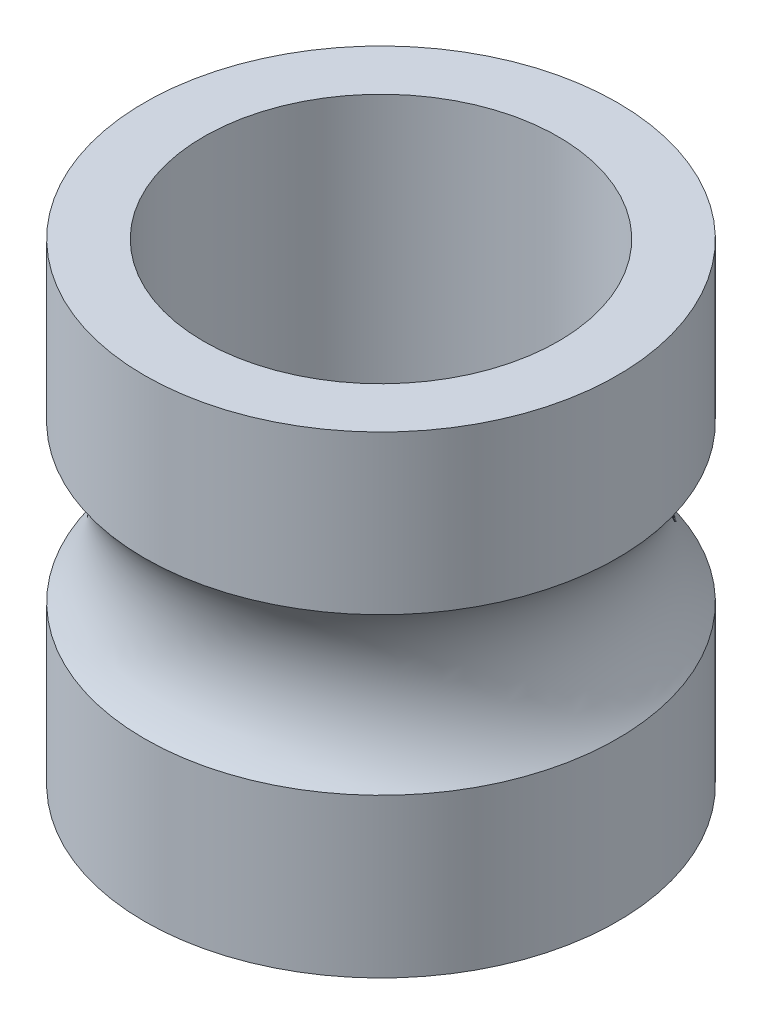
ISO-10303-21;
HEADER;
FILE_DESCRIPTION(('STEP AP214'),'2;1');
FILE_NAME('part.step','',(''),(''),'','','');
FILE_SCHEMA(('AUTOMOTIVE_DESIGN { 1 0 10303 214 1 1 1 1 }'));
ENDSEC;
DATA;
#1=APPLICATION_CONTEXT('core data for automotive mechanical design processes');
#2=APPLICATION_PROTOCOL_DEFINITION('international standard','automotive_design',2000,#1);
#3=PRODUCT_CONTEXT('',#1,'mechanical');
#4=PRODUCT('Part','Part','',(#3));
#5=PRODUCT_RELATED_PRODUCT_CATEGORY('part','',(#4));
#6=PRODUCT_DEFINITION_FORMATION('','',#4);
#7=PRODUCT_DEFINITION_CONTEXT('part definition',#1,'design');
#8=PRODUCT_DEFINITION('design','',#6,#7);
#9=PRODUCT_DEFINITION_SHAPE('','',#8);
#10=(LENGTH_UNIT() NAMED_UNIT(*) SI_UNIT(.MILLI.,.METRE.));
#11=(NAMED_UNIT(*) PLANE_ANGLE_UNIT() SI_UNIT($,.RADIAN.));
#12=(NAMED_UNIT(*) SI_UNIT($,.STERADIAN.) SOLID_ANGLE_UNIT());
#13=UNCERTAINTY_MEASURE_WITH_UNIT(LENGTH_MEASURE(1.E-05),#10,'distance_accuracy_value','');
#14=(GEOMETRIC_REPRESENTATION_CONTEXT(3) GLOBAL_UNCERTAINTY_ASSIGNED_CONTEXT((#13)) GLOBAL_UNIT_ASSIGNED_CONTEXT((#10,
#11,#12)) REPRESENTATION_CONTEXT('',''));
#15=CARTESIAN_POINT('',(0.,0.,0.));
#16=DIRECTION('',(0.,0.,1.));
#17=DIRECTION('',(1.,0.,0.));
#18=AXIS2_PLACEMENT_3D('',#15,#16,#17);
#19=CARTESIAN_POINT('',(0.,2.,0.));
#20=DIRECTION('',(0.,-1.,0.));
#21=DIRECTION('',(0.,0.,-1.));
#22=AXIS2_PLACEMENT_3D('',#19,#20,#21);
#23=CYLINDRICAL_SURFACE('',#22,2.);
#24=CARTESIAN_POINT('',(0.,2.,0.));
#25=DIRECTION('',(0.,1.,0.));
#26=DIRECTION('',(0.,0.,1.));
#27=AXIS2_PLACEMENT_3D('',#24,#25,#26);
#28=CIRCLE('',#27,2.);
#29=CARTESIAN_POINT('',(0.,2.,2.));
#30=VERTEX_POINT('',#29);
#31=EDGE_CURVE('E10',#30,#30,#28,.T.);
#32=ORIENTED_EDGE('',*,*,#31,.F.);
#33=EDGE_LOOP('',(#32));
#34=FACE_BOUND('',#33,.T.);
#35=CARTESIAN_POINT('',(0.,0.661437827766148,0.));
#36=DIRECTION('',(0.,-1.,0.));
#37=DIRECTION('',(0.,0.,-1.));
#38=AXIS2_PLACEMENT_3D('',#35,#36,#37);
#39=CIRCLE('',#38,2.);
#40=CARTESIAN_POINT('',(0.,0.661437827766148,-2.));
#41=VERTEX_POINT('',#40);
#42=EDGE_CURVE('E37',#41,#41,#39,.T.);
#43=ORIENTED_EDGE('',*,*,#42,.F.);
#44=EDGE_LOOP('',(#43));
#45=FACE_BOUND('',#44,.T.);
#46=ADVANCED_FACE('F34',(#34,#45),#23,.T.);
#47=CARTESIAN_POINT('',(0.,-2.,0.));
#48=DIRECTION('',(0.,1.,0.));
#49=DIRECTION('',(0.,0.,1.));
#50=AXIS2_PLACEMENT_3D('',#47,#48,#49);
#51=CIRCLE('',#50,2.);
#52=CARTESIAN_POINT('',(0.,-2.,2.));
#53=VERTEX_POINT('',#52);
#54=EDGE_CURVE('E42',#53,#53,#51,.T.);
#55=ORIENTED_EDGE('',*,*,#54,.T.);
#56=EDGE_LOOP('',(#55));
#57=FACE_BOUND('',#56,.T.);
#58=CARTESIAN_POINT('',(0.,-0.661437827766148,0.));
#59=DIRECTION('',(0.,1.,0.));
#60=DIRECTION('',(0.,0.,1.));
#61=AXIS2_PLACEMENT_3D('',#58,#59,#60);
#62=CIRCLE('',#61,2.);
#63=CARTESIAN_POINT('',(0.,-0.661437827766148,2.));
#64=VERTEX_POINT('',#63);
#65=EDGE_CURVE('E54',#64,#64,#62,.T.);
#66=ORIENTED_EDGE('',*,*,#65,.F.);
#67=EDGE_LOOP('',(#66));
#68=FACE_BOUND('',#67,.T.);
#69=ADVANCED_FACE('F76',(#57,#68),#23,.T.);
#70=CARTESIAN_POINT('',(0.,2.,0.));
#71=DIRECTION('',(0.,1.,0.));
#72=DIRECTION('',(0.,0.,1.));
#73=AXIS2_PLACEMENT_3D('',#70,#71,#72);
#74=PLANE('',#73);
#75=ORIENTED_EDGE('',*,*,#31,.T.);
#76=EDGE_LOOP('',(#75));
#77=FACE_BOUND('',#76,.T.);
#78=CARTESIAN_POINT('',(0.,2.,0.));
#79=DIRECTION('',(0.,1.,0.));
#80=DIRECTION('',(0.,0.,1.));
#81=AXIS2_PLACEMENT_3D('',#78,#79,#80);
#82=CIRCLE('',#81,1.5);
#83=CARTESIAN_POINT('',(0.,2.,1.5));
#84=VERTEX_POINT('',#83);
#85=EDGE_CURVE('E49',#84,#84,#82,.T.);
#86=ORIENTED_EDGE('',*,*,#85,.F.);
#87=EDGE_LOOP('',(#86));
#88=FACE_BOUND('',#87,.T.);
#89=ADVANCED_FACE('F73',(#77,#88),#74,.T.);
#90=CARTESIAN_POINT('',(0.,-2.,0.));
#91=DIRECTION('',(0.,1.,0.));
#92=DIRECTION('',(0.,0.,1.));
#93=AXIS2_PLACEMENT_3D('',#90,#91,#92);
#94=PLANE('',#93);
#95=ORIENTED_EDGE('',*,*,#54,.F.);
#96=EDGE_LOOP('',(#95));
#97=FACE_BOUND('',#96,.T.);
#98=CARTESIAN_POINT('',(0.,-2.,0.));
#99=DIRECTION('',(0.,1.,0.));
#100=DIRECTION('',(0.,0.,1.));
#101=AXIS2_PLACEMENT_3D('',#98,#99,#100);
#102=CIRCLE('',#101,1.5);
#103=CARTESIAN_POINT('',(0.,-2.,1.5));
#104=VERTEX_POINT('',#103);
#105=EDGE_CURVE('E52',#104,#104,#102,.T.);
#106=ORIENTED_EDGE('',*,*,#105,.T.);
#107=EDGE_LOOP('',(#106));
#108=FACE_BOUND('',#107,.T.);
#109=ADVANCED_FACE('F75',(#97,#108),#94,.F.);
#110=CARTESIAN_POINT('',(0.,2.,0.));
#111=DIRECTION('',(0.,-1.,0.));
#112=DIRECTION('',(0.,0.,-1.));
#113=AXIS2_PLACEMENT_3D('',#110,#111,#112);
#114=CYLINDRICAL_SURFACE('',#113,1.5);
#115=ORIENTED_EDGE('',*,*,#85,.T.);
#116=EDGE_LOOP('',(#115));
#117=FACE_BOUND('',#116,.T.);
#118=ORIENTED_EDGE('',*,*,#105,.F.);
#119=EDGE_LOOP('',(#118));
#120=FACE_BOUND('',#119,.T.);
#121=ADVANCED_FACE('F70',(#117,#120),#114,.F.);
#122=CARTESIAN_POINT('',(0.,0.,0.));
#123=DIRECTION('',(0.,1.,0.));
#124=DIRECTION('',(0.,0.,1.));
#125=AXIS2_PLACEMENT_3D('',#122,#123,#124);
#126=TOROIDAL_SURFACE('',#125,2.75,1.);
#127=ORIENTED_EDGE('',*,*,#65,.T.);
#128=EDGE_LOOP('',(#127));
#129=FACE_BOUND('',#128,.T.);
#130=ORIENTED_EDGE('',*,*,#42,.T.);
#131=EDGE_LOOP('',(#130));
#132=FACE_BOUND('',#131,.T.);
#133=ADVANCED_FACE('F109',(#129,#132),#126,.F.);
#134=CLOSED_SHELL('',(#46,#69,#89,#109,#121,#133));
#135=MANIFOLD_SOLID_BREP('B2',#134);
#136=ADVANCED_BREP_SHAPE_REPRESENTATION('',(#18,#135),#14);
#137=SHAPE_DEFINITION_REPRESENTATION(#9,#136);
ENDSEC;
END-ISO-10303-21;
